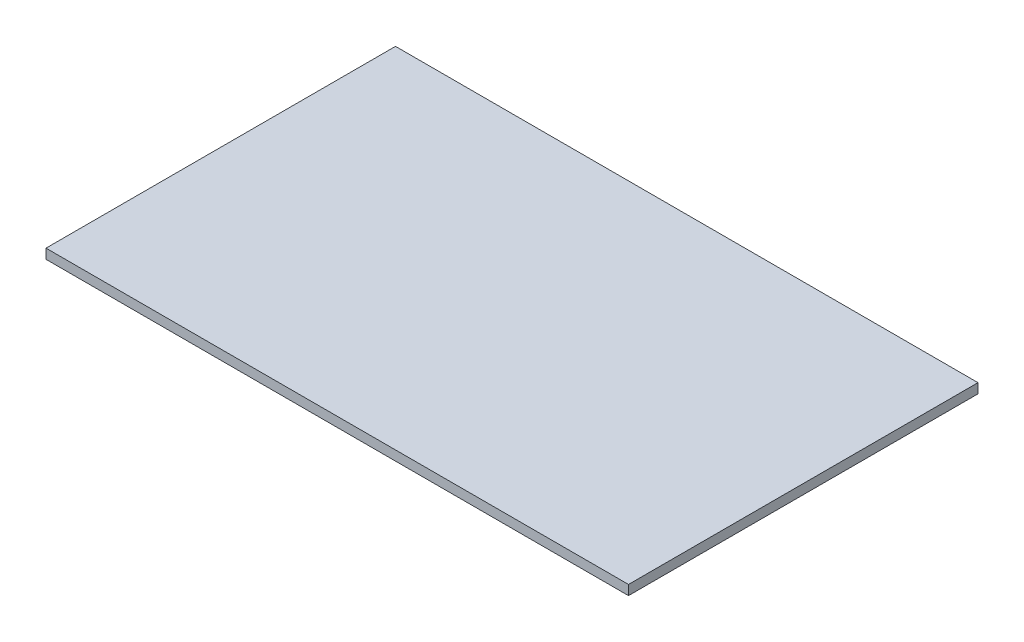
ISO-10303-21;
HEADER;
FILE_DESCRIPTION(('STEP AP214'),'2;1');
FILE_NAME('part.step','',(''),(''),'','','');
FILE_SCHEMA(('AUTOMOTIVE_DESIGN { 1 0 10303 214 1 1 1 1 }'));
ENDSEC;
DATA;
#1=APPLICATION_CONTEXT('core data for automotive mechanical design processes');
#2=APPLICATION_PROTOCOL_DEFINITION('international standard','automotive_design',2000,#1);
#3=PRODUCT_CONTEXT('',#1,'mechanical');
#4=PRODUCT('Part','Part','',(#3));
#5=PRODUCT_RELATED_PRODUCT_CATEGORY('part','',(#4));
#6=PRODUCT_DEFINITION_FORMATION('','',#4);
#7=PRODUCT_DEFINITION_CONTEXT('part definition',#1,'design');
#8=PRODUCT_DEFINITION('design','',#6,#7);
#9=PRODUCT_DEFINITION_SHAPE('','',#8);
#10=(LENGTH_UNIT() NAMED_UNIT(*) SI_UNIT(.MILLI.,.METRE.));
#11=(NAMED_UNIT(*) PLANE_ANGLE_UNIT() SI_UNIT($,.RADIAN.));
#12=(NAMED_UNIT(*) SI_UNIT($,.STERADIAN.) SOLID_ANGLE_UNIT());
#13=UNCERTAINTY_MEASURE_WITH_UNIT(LENGTH_MEASURE(1.E-05),#10,'distance_accuracy_value','');
#14=(GEOMETRIC_REPRESENTATION_CONTEXT(3) GLOBAL_UNCERTAINTY_ASSIGNED_CONTEXT((#13)) GLOBAL_UNIT_ASSIGNED_CONTEXT((#10,
#11,#12)) REPRESENTATION_CONTEXT('',''));
#15=CARTESIAN_POINT('',(0.,0.,0.));
#16=DIRECTION('',(0.,0.,1.));
#17=DIRECTION('',(1.,0.,0.));
#18=AXIS2_PLACEMENT_3D('',#15,#16,#17);
#19=CARTESIAN_POINT('',(300.,10.,-180.));
#20=DIRECTION('',(-1.,0.,0.));
#21=DIRECTION('',(0.,0.,1.));
#22=AXIS2_PLACEMENT_3D('',#19,#20,#21);
#23=PLANE('',#22);
#24=DIRECTION('',(0.,0.,-1.));
#25=VECTOR('',#24,1.);
#26=CARTESIAN_POINT('',(300.,0.,-180.));
#27=LINE('',#26,#25);
#28=CARTESIAN_POINT('',(300.,0.,180.));
#29=VERTEX_POINT('',#28);
#30=CARTESIAN_POINT('',(300.,0.,-180.));
#31=VERTEX_POINT('',#30);
#32=EDGE_CURVE('E100',#29,#31,#27,.T.);
#33=ORIENTED_EDGE('',*,*,#32,.T.);
#34=DIRECTION('',(0.,-1.,0.));
#35=VECTOR('',#34,1.);
#36=CARTESIAN_POINT('',(300.,10.,-180.));
#37=LINE('',#36,#35);
#38=CARTESIAN_POINT('',(300.,10.,-180.));
#39=VERTEX_POINT('',#38);
#40=EDGE_CURVE('E11',#39,#31,#37,.T.);
#41=ORIENTED_EDGE('',*,*,#40,.F.);
#42=DIRECTION('',(0.,0.,-1.));
#43=VECTOR('',#42,1.);
#44=CARTESIAN_POINT('',(300.,10.,-180.));
#45=LINE('',#44,#43);
#46=CARTESIAN_POINT('',(300.,10.,180.));
#47=VERTEX_POINT('',#46);
#48=EDGE_CURVE('E88',#47,#39,#45,.T.);
#49=ORIENTED_EDGE('',*,*,#48,.F.);
#50=DIRECTION('',(0.,-1.,0.));
#51=VECTOR('',#50,1.);
#52=CARTESIAN_POINT('',(300.,10.,180.));
#53=LINE('',#52,#51);
#54=EDGE_CURVE('E96',#47,#29,#53,.T.);
#55=ORIENTED_EDGE('',*,*,#54,.T.);
#56=EDGE_LOOP('',(#33,#41,#49,#55));
#57=FACE_BOUND('',#56,.T.);
#58=ADVANCED_FACE('F37',(#57),#23,.F.);
#59=CARTESIAN_POINT('',(-300.,10.,-180.));
#60=DIRECTION('',(0.,0.,1.));
#61=DIRECTION('',(1.,0.,0.));
#62=AXIS2_PLACEMENT_3D('',#59,#60,#61);
#63=PLANE('',#62);
#64=DIRECTION('',(-1.,0.,0.));
#65=VECTOR('',#64,1.);
#66=CARTESIAN_POINT('',(-300.,0.,-180.));
#67=LINE('',#66,#65);
#68=CARTESIAN_POINT('',(-300.,0.,-180.));
#69=VERTEX_POINT('',#68);
#70=EDGE_CURVE('E92',#31,#69,#67,.T.);
#71=ORIENTED_EDGE('',*,*,#70,.T.);
#72=DIRECTION('',(0.,-1.,0.));
#73=VECTOR('',#72,1.);
#74=CARTESIAN_POINT('',(-300.,10.,-180.));
#75=LINE('',#74,#73);
#76=CARTESIAN_POINT('',(-300.,10.,-180.));
#77=VERTEX_POINT('',#76);
#78=EDGE_CURVE('E45',#77,#69,#75,.T.);
#79=ORIENTED_EDGE('',*,*,#78,.F.);
#80=DIRECTION('',(-1.,0.,0.));
#81=VECTOR('',#80,1.);
#82=CARTESIAN_POINT('',(-300.,10.,-180.));
#83=LINE('',#82,#81);
#84=EDGE_CURVE('E83',#39,#77,#83,.T.);
#85=ORIENTED_EDGE('',*,*,#84,.F.);
#86=ORIENTED_EDGE('',*,*,#40,.T.);
#87=EDGE_LOOP('',(#71,#79,#85,#86));
#88=FACE_BOUND('',#87,.T.);
#89=ADVANCED_FACE('F91',(#88),#63,.F.);
#90=CARTESIAN_POINT('',(-300.,10.,-180.));
#91=DIRECTION('',(1.,0.,0.));
#92=DIRECTION('',(0.,0.,-1.));
#93=AXIS2_PLACEMENT_3D('',#90,#91,#92);
#94=PLANE('',#93);
#95=DIRECTION('',(0.,0.,1.));
#96=VECTOR('',#95,1.);
#97=CARTESIAN_POINT('',(-300.,0.,-180.));
#98=LINE('',#97,#96);
#99=CARTESIAN_POINT('',(-300.,0.,180.));
#100=VERTEX_POINT('',#99);
#101=EDGE_CURVE('E70',#69,#100,#98,.T.);
#102=ORIENTED_EDGE('',*,*,#101,.T.);
#103=DIRECTION('',(0.,-1.,0.));
#104=VECTOR('',#103,1.);
#105=CARTESIAN_POINT('',(-300.,10.,180.));
#106=LINE('',#105,#104);
#107=CARTESIAN_POINT('',(-300.,10.,180.));
#108=VERTEX_POINT('',#107);
#109=EDGE_CURVE('E93',#108,#100,#106,.T.);
#110=ORIENTED_EDGE('',*,*,#109,.F.);
#111=DIRECTION('',(0.,0.,1.));
#112=VECTOR('',#111,1.);
#113=CARTESIAN_POINT('',(-300.,10.,-180.));
#114=LINE('',#113,#112);
#115=EDGE_CURVE('E86',#77,#108,#114,.T.);
#116=ORIENTED_EDGE('',*,*,#115,.F.);
#117=ORIENTED_EDGE('',*,*,#78,.T.);
#118=EDGE_LOOP('',(#102,#110,#116,#117));
#119=FACE_BOUND('',#118,.T.);
#120=ADVANCED_FACE('F94',(#119),#94,.F.);
#121=CARTESIAN_POINT('',(-300.,10.,180.));
#122=DIRECTION('',(0.,0.,-1.));
#123=DIRECTION('',(-1.,0.,0.));
#124=AXIS2_PLACEMENT_3D('',#121,#122,#123);
#125=PLANE('',#124);
#126=DIRECTION('',(1.,0.,0.));
#127=VECTOR('',#126,1.);
#128=CARTESIAN_POINT('',(-300.,0.,180.));
#129=LINE('',#128,#127);
#130=EDGE_CURVE('E76',#100,#29,#129,.T.);
#131=ORIENTED_EDGE('',*,*,#130,.T.);
#132=ORIENTED_EDGE('',*,*,#54,.F.);
#133=DIRECTION('',(1.,0.,0.));
#134=VECTOR('',#133,1.);
#135=CARTESIAN_POINT('',(-300.,10.,180.));
#136=LINE('',#135,#134);
#137=EDGE_CURVE('E53',#108,#47,#136,.T.);
#138=ORIENTED_EDGE('',*,*,#137,.F.);
#139=ORIENTED_EDGE('',*,*,#109,.T.);
#140=EDGE_LOOP('',(#131,#132,#138,#139));
#141=FACE_BOUND('',#140,.T.);
#142=ADVANCED_FACE('F107',(#141),#125,.F.);
#143=CARTESIAN_POINT('',(0.,10.,0.));
#144=DIRECTION('',(0.,1.,0.));
#145=DIRECTION('',(0.,0.,1.));
#146=AXIS2_PLACEMENT_3D('',#143,#144,#145);
#147=PLANE('',#146);
#148=ORIENTED_EDGE('',*,*,#48,.T.);
#149=ORIENTED_EDGE('',*,*,#84,.T.);
#150=ORIENTED_EDGE('',*,*,#115,.T.);
#151=ORIENTED_EDGE('',*,*,#137,.T.);
#152=EDGE_LOOP('',(#148,#149,#150,#151));
#153=FACE_BOUND('',#152,.T.);
#154=ADVANCED_FACE('F84',(#153),#147,.T.);
#155=CARTESIAN_POINT('',(0.,0.,0.));
#156=DIRECTION('',(0.,1.,0.));
#157=DIRECTION('',(0.,0.,1.));
#158=AXIS2_PLACEMENT_3D('',#155,#156,#157);
#159=PLANE('',#158);
#160=ORIENTED_EDGE('',*,*,#32,.F.);
#161=ORIENTED_EDGE('',*,*,#130,.F.);
#162=ORIENTED_EDGE('',*,*,#101,.F.);
#163=ORIENTED_EDGE('',*,*,#70,.F.);
#164=EDGE_LOOP('',(#160,#161,#162,#163));
#165=FACE_BOUND('',#164,.T.);
#166=ADVANCED_FACE('F110',(#165),#159,.F.);
#167=CLOSED_SHELL('',(#58,#89,#120,#142,#154,#166));
#168=MANIFOLD_SOLID_BREP('B2',#167);
#169=ADVANCED_BREP_SHAPE_REPRESENTATION('',(#18,#168),#14);
#170=SHAPE_DEFINITION_REPRESENTATION(#9,#169);
ENDSEC;
END-ISO-10303-21;
